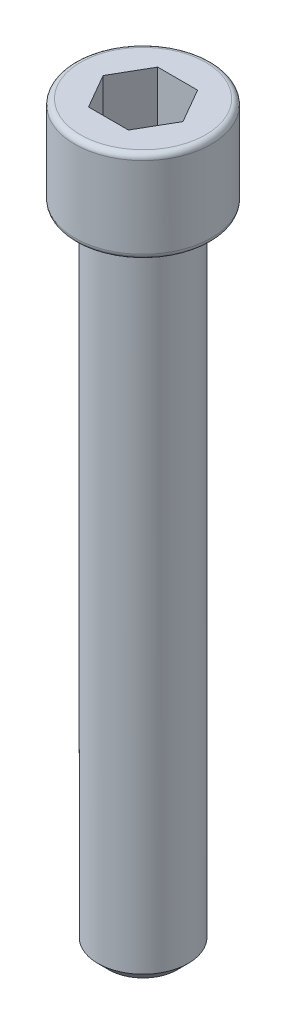
ISO-10303-21;
HEADER;
FILE_DESCRIPTION(('STEP AP214'),'2;1');
FILE_NAME('part.step','',(''),(''),'','','');
FILE_SCHEMA(('AUTOMOTIVE_DESIGN { 1 0 10303 214 1 1 1 1 }'));
ENDSEC;
DATA;
#1=APPLICATION_CONTEXT('core data for automotive mechanical design processes');
#2=APPLICATION_PROTOCOL_DEFINITION('international standard','automotive_design',2000,#1);
#3=PRODUCT_CONTEXT('',#1,'mechanical');
#4=PRODUCT('Part','Part','',(#3));
#5=PRODUCT_RELATED_PRODUCT_CATEGORY('part','',(#4));
#6=PRODUCT_DEFINITION_FORMATION('','',#4);
#7=PRODUCT_DEFINITION_CONTEXT('part definition',#1,'design');
#8=PRODUCT_DEFINITION('design','',#6,#7);
#9=PRODUCT_DEFINITION_SHAPE('','',#8);
#10=(LENGTH_UNIT() NAMED_UNIT(*) SI_UNIT(.MILLI.,.METRE.));
#11=(NAMED_UNIT(*) PLANE_ANGLE_UNIT() SI_UNIT($,.RADIAN.));
#12=(NAMED_UNIT(*) SI_UNIT($,.STERADIAN.) SOLID_ANGLE_UNIT());
#13=UNCERTAINTY_MEASURE_WITH_UNIT(LENGTH_MEASURE(1.E-05),#10,'distance_accuracy_value','');
#14=(GEOMETRIC_REPRESENTATION_CONTEXT(3) GLOBAL_UNCERTAINTY_ASSIGNED_CONTEXT((#13)) GLOBAL_UNIT_ASSIGNED_CONTEXT((#10,
#11,#12)) REPRESENTATION_CONTEXT('',''));
#15=CARTESIAN_POINT('',(0.,0.,0.));
#16=DIRECTION('',(0.,0.,1.));
#17=DIRECTION('',(1.,0.,0.));
#18=AXIS2_PLACEMENT_3D('',#15,#16,#17);
#19=CARTESIAN_POINT('',(-3.1115,0.,0.));
#20=DIRECTION('',(0.,1.,0.));
#21=DIRECTION('',(0.,0.,1.));
#22=AXIS2_PLACEMENT_3D('',#19,#20,#21);
#23=PLANE('',#22);
#24=CARTESIAN_POINT('',(0.,0.,0.));
#25=DIRECTION('',(0.,1.,0.));
#26=DIRECTION('',(0.,0.,1.));
#27=AXIS2_PLACEMENT_3D('',#24,#25,#26);
#28=CIRCLE('',#27,2.34949999999999);
#29=CARTESIAN_POINT('',(0.,0.,2.34949999999999));
#30=VERTEX_POINT('',#29);
#31=EDGE_CURVE('E42',#30,#30,#28,.F.);
#32=ORIENTED_EDGE('',*,*,#31,.T.);
#33=EDGE_LOOP('',(#32));
#34=FACE_BOUND('',#33,.T.);
#35=ADVANCED_FACE('F34',(#34),#23,.F.);
#36=CARTESIAN_POINT('',(0.,50.8,0.));
#37=DIRECTION('',(0.,-1.,0.));
#38=DIRECTION('',(0.,0.,-1.));
#39=AXIS2_PLACEMENT_3D('',#36,#37,#38);
#40=PLANE('',#39);
#41=CARTESIAN_POINT('',(0.,50.8,0.));
#42=DIRECTION('',(0.,-1.,0.));
#43=DIRECTION('',(0.,0.,-1.));
#44=AXIS2_PLACEMENT_3D('',#41,#42,#43);
#45=CIRCLE('',#44,4.318);
#46=CARTESIAN_POINT('',(0.,50.8,-4.318));
#47=VERTEX_POINT('',#46);
#48=EDGE_CURVE('E153',#47,#47,#45,.F.);
#49=ORIENTED_EDGE('',*,*,#48,.T.);
#50=EDGE_LOOP('',(#49));
#51=FACE_BOUND('',#50,.T.);
#52=DIRECTION('',(-0.5,0.,-0.866025403784438));
#53=VECTOR('',#52,1.);
#54=CARTESIAN_POINT('',(2.74962619987152,50.8,0.));
#55=LINE('',#54,#53);
#56=CARTESIAN_POINT('',(2.74962619987152,50.8,0.));
#57=VERTEX_POINT('',#56);
#58=CARTESIAN_POINT('',(1.37481309993576,50.8,-2.38124614));
#59=VERTEX_POINT('',#58);
#60=EDGE_CURVE('E123',#57,#59,#55,.T.);
#61=ORIENTED_EDGE('',*,*,#60,.F.);
#62=DIRECTION('',(0.5,0.,-0.866025403784439));
#63=VECTOR('',#62,1.);
#64=CARTESIAN_POINT('',(1.37481309993576,50.8,2.38124614));
#65=LINE('',#64,#63);
#66=CARTESIAN_POINT('',(1.37481309993576,50.8,2.38124614));
#67=VERTEX_POINT('',#66);
#68=EDGE_CURVE('E49',#67,#57,#65,.T.);
#69=ORIENTED_EDGE('',*,*,#68,.F.);
#70=DIRECTION('',(1.,0.,0.));
#71=VECTOR('',#70,1.);
#72=CARTESIAN_POINT('',(-1.37481309993576,50.8,2.38124614));
#73=LINE('',#72,#71);
#74=CARTESIAN_POINT('',(-1.37481309993576,50.8,2.38124614));
#75=VERTEX_POINT('',#74);
#76=EDGE_CURVE('E132',#75,#67,#73,.T.);
#77=ORIENTED_EDGE('',*,*,#76,.F.);
#78=DIRECTION('',(0.5,0.,0.866025403784439));
#79=VECTOR('',#78,1.);
#80=CARTESIAN_POINT('',(-2.74962619987151,50.8,0.));
#81=LINE('',#80,#79);
#82=CARTESIAN_POINT('',(-2.74962619987151,50.8,0.));
#83=VERTEX_POINT('',#82);
#84=EDGE_CURVE('E130',#83,#75,#81,.T.);
#85=ORIENTED_EDGE('',*,*,#84,.F.);
#86=DIRECTION('',(-0.5,0.,0.866025403784439));
#87=VECTOR('',#86,1.);
#88=CARTESIAN_POINT('',(-1.37481309993576,50.8,-2.38124614));
#89=LINE('',#88,#87);
#90=CARTESIAN_POINT('',(-1.37481309993576,50.8,-2.38124614));
#91=VERTEX_POINT('',#90);
#92=EDGE_CURVE('E97',#91,#83,#89,.T.);
#93=ORIENTED_EDGE('',*,*,#92,.F.);
#94=DIRECTION('',(-1.,0.,0.));
#95=VECTOR('',#94,1.);
#96=CARTESIAN_POINT('',(1.37481309993576,50.8,-2.38124614));
#97=LINE('',#96,#95);
#98=EDGE_CURVE('E126',#59,#91,#97,.T.);
#99=ORIENTED_EDGE('',*,*,#98,.F.);
#100=EDGE_LOOP('',(#61,#69,#77,#85,#93,#99));
#101=FACE_BOUND('',#100,.T.);
#102=ADVANCED_FACE('F169',(#51,#101),#40,.F.);
#103=CARTESIAN_POINT('',(0.,0.,0.));
#104=DIRECTION('',(0.,-1.,0.));
#105=DIRECTION('',(0.,0.,-1.));
#106=AXIS2_PLACEMENT_3D('',#103,#104,#105);
#107=CYLINDRICAL_SURFACE('',#106,4.699);
#108=CARTESIAN_POINT('',(0.,44.831,0.));
#109=DIRECTION('',(0.,1.,0.));
#110=DIRECTION('',(0.,0.,1.));
#111=AXIS2_PLACEMENT_3D('',#108,#109,#110);
#112=CIRCLE('',#111,4.699);
#113=CARTESIAN_POINT('',(0.,44.831,4.699));
#114=VERTEX_POINT('',#113);
#115=EDGE_CURVE('E150',#114,#114,#112,.T.);
#116=ORIENTED_EDGE('',*,*,#115,.T.);
#117=EDGE_LOOP('',(#116));
#118=FACE_BOUND('',#117,.T.);
#119=CARTESIAN_POINT('',(0.,50.419,0.));
#120=DIRECTION('',(0.,-1.,0.));
#121=DIRECTION('',(0.,0.,-1.));
#122=AXIS2_PLACEMENT_3D('',#119,#120,#121);
#123=CIRCLE('',#122,4.699);
#124=CARTESIAN_POINT('',(0.,50.419,-4.699));
#125=VERTEX_POINT('',#124);
#126=EDGE_CURVE('E147',#125,#125,#123,.T.);
#127=ORIENTED_EDGE('',*,*,#126,.T.);
#128=EDGE_LOOP('',(#127));
#129=FACE_BOUND('',#128,.T.);
#130=ADVANCED_FACE('F174',(#118,#129),#107,.T.);
#131=CARTESIAN_POINT('',(-4.699,44.45,0.));
#132=DIRECTION('',(0.,1.,0.));
#133=DIRECTION('',(0.,0.,1.));
#134=AXIS2_PLACEMENT_3D('',#131,#132,#133);
#135=PLANE('',#134);
#136=CARTESIAN_POINT('',(0.,44.45,0.));
#137=DIRECTION('',(0.,1.,0.));
#138=DIRECTION('',(0.,0.,1.));
#139=AXIS2_PLACEMENT_3D('',#136,#137,#138);
#140=CIRCLE('',#139,4.318);
#141=CARTESIAN_POINT('',(0.,44.45,4.318));
#142=VERTEX_POINT('',#141);
#143=EDGE_CURVE('E144',#142,#142,#140,.F.);
#144=ORIENTED_EDGE('',*,*,#143,.T.);
#145=EDGE_LOOP('',(#144));
#146=FACE_BOUND('',#145,.T.);
#147=CARTESIAN_POINT('',(0.,44.45,0.));
#148=DIRECTION('',(0.,-1.,0.));
#149=DIRECTION('',(0.,0.,-1.));
#150=AXIS2_PLACEMENT_3D('',#147,#148,#149);
#151=CIRCLE('',#150,3.1115);
#152=CARTESIAN_POINT('',(0.,44.45,-3.1115));
#153=VERTEX_POINT('',#152);
#154=EDGE_CURVE('E136',#153,#153,#151,.T.);
#155=ORIENTED_EDGE('',*,*,#154,.F.);
#156=EDGE_LOOP('',(#155));
#157=FACE_BOUND('',#156,.T.);
#158=ADVANCED_FACE('F190',(#146,#157),#135,.F.);
#159=CARTESIAN_POINT('',(0.,0.,0.));
#160=DIRECTION('',(0.,-1.,0.));
#161=DIRECTION('',(0.,0.,-1.));
#162=AXIS2_PLACEMENT_3D('',#159,#160,#161);
#163=CYLINDRICAL_SURFACE('',#162,3.1115);
#164=CARTESIAN_POINT('',(0.,0.762000000000011,0.));
#165=DIRECTION('',(0.,1.,0.));
#166=DIRECTION('',(0.,0.,1.));
#167=AXIS2_PLACEMENT_3D('',#164,#165,#166);
#168=CIRCLE('',#167,3.1115);
#169=CARTESIAN_POINT('',(0.,0.762000000000011,3.1115));
#170=VERTEX_POINT('',#169);
#171=EDGE_CURVE('E11',#170,#170,#168,.T.);
#172=ORIENTED_EDGE('',*,*,#171,.T.);
#173=EDGE_LOOP('',(#172));
#174=FACE_BOUND('',#173,.T.);
#175=ORIENTED_EDGE('',*,*,#154,.T.);
#176=EDGE_LOOP('',(#175));
#177=FACE_BOUND('',#176,.T.);
#178=ADVANCED_FACE('F193',(#174,#177),#163,.T.);
#179=CARTESIAN_POINT('',(1.37481309993576,46.99,2.38124614));
#180=DIRECTION('',(0.866025403784439,0.,0.5));
#181=DIRECTION('',(0.5,0.,-0.866025403784439));
#182=AXIS2_PLACEMENT_3D('',#179,#180,#181);
#183=PLANE('',#182);
#184=ORIENTED_EDGE('',*,*,#68,.T.);
#185=DIRECTION('',(0.,1.,0.));
#186=VECTOR('',#185,1.);
#187=CARTESIAN_POINT('',(2.74962619987152,46.99,0.));
#188=LINE('',#187,#186);
#189=CARTESIAN_POINT('',(2.74962619987152,46.99,0.));
#190=VERTEX_POINT('',#189);
#191=EDGE_CURVE('E79',#190,#57,#188,.T.);
#192=ORIENTED_EDGE('',*,*,#191,.F.);
#193=DIRECTION('',(0.5,0.,-0.866025403784439));
#194=VECTOR('',#193,1.);
#195=CARTESIAN_POINT('',(1.37481309993576,46.99,2.38124614));
#196=LINE('',#195,#194);
#197=CARTESIAN_POINT('',(1.37481309993576,46.99,2.38124614));
#198=VERTEX_POINT('',#197);
#199=EDGE_CURVE('E134',#198,#190,#196,.T.);
#200=ORIENTED_EDGE('',*,*,#199,.F.);
#201=DIRECTION('',(0.,1.,0.));
#202=VECTOR('',#201,1.);
#203=CARTESIAN_POINT('',(1.37481309993576,46.99,2.38124614));
#204=LINE('',#203,#202);
#205=EDGE_CURVE('E57',#198,#67,#204,.T.);
#206=ORIENTED_EDGE('',*,*,#205,.T.);
#207=EDGE_LOOP('',(#184,#192,#200,#206));
#208=FACE_BOUND('',#207,.T.);
#209=ADVANCED_FACE('F198',(#208),#183,.F.);
#210=CARTESIAN_POINT('',(-1.37481309993576,46.99,2.38124614));
#211=DIRECTION('',(0.,0.,1.));
#212=DIRECTION('',(1.,0.,0.));
#213=AXIS2_PLACEMENT_3D('',#210,#211,#212);
#214=PLANE('',#213);
#215=ORIENTED_EDGE('',*,*,#76,.T.);
#216=ORIENTED_EDGE('',*,*,#205,.F.);
#217=DIRECTION('',(1.,0.,0.));
#218=VECTOR('',#217,1.);
#219=CARTESIAN_POINT('',(-1.37481309993576,46.99,2.38124614));
#220=LINE('',#219,#218);
#221=CARTESIAN_POINT('',(-1.37481309993576,46.99,2.38124614));
#222=VERTEX_POINT('',#221);
#223=EDGE_CURVE('E109',#222,#198,#220,.T.);
#224=ORIENTED_EDGE('',*,*,#223,.F.);
#225=DIRECTION('',(0.,1.,0.));
#226=VECTOR('',#225,1.);
#227=CARTESIAN_POINT('',(-1.37481309993576,46.99,2.38124614));
#228=LINE('',#227,#226);
#229=EDGE_CURVE('E101',#222,#75,#228,.T.);
#230=ORIENTED_EDGE('',*,*,#229,.T.);
#231=EDGE_LOOP('',(#215,#216,#224,#230));
#232=FACE_BOUND('',#231,.T.);
#233=ADVANCED_FACE('F204',(#232),#214,.F.);
#234=CARTESIAN_POINT('',(-2.74962619987151,46.99,0.));
#235=DIRECTION('',(-0.866025403784438,0.,0.5));
#236=DIRECTION('',(0.5,0.,0.866025403784439));
#237=AXIS2_PLACEMENT_3D('',#234,#235,#236);
#238=PLANE('',#237);
#239=ORIENTED_EDGE('',*,*,#84,.T.);
#240=ORIENTED_EDGE('',*,*,#229,.F.);
#241=DIRECTION('',(0.5,0.,0.866025403784439));
#242=VECTOR('',#241,1.);
#243=CARTESIAN_POINT('',(-2.74962619987151,46.99,0.));
#244=LINE('',#243,#242);
#245=CARTESIAN_POINT('',(-2.74962619987151,46.99,0.));
#246=VERTEX_POINT('',#245);
#247=EDGE_CURVE('E105',#246,#222,#244,.T.);
#248=ORIENTED_EDGE('',*,*,#247,.F.);
#249=DIRECTION('',(0.,1.,0.));
#250=VECTOR('',#249,1.);
#251=CARTESIAN_POINT('',(-2.74962619987151,46.99,0.));
#252=LINE('',#251,#250);
#253=EDGE_CURVE('E90',#246,#83,#252,.T.);
#254=ORIENTED_EDGE('',*,*,#253,.T.);
#255=EDGE_LOOP('',(#239,#240,#248,#254));
#256=FACE_BOUND('',#255,.T.);
#257=ADVANCED_FACE('F106',(#256),#238,.F.);
#258=CARTESIAN_POINT('',(-1.37481309993576,46.99,-2.38124614));
#259=DIRECTION('',(-0.866025403784439,0.,-0.5));
#260=DIRECTION('',(-0.5,0.,0.866025403784439));
#261=AXIS2_PLACEMENT_3D('',#258,#259,#260);
#262=PLANE('',#261);
#263=ORIENTED_EDGE('',*,*,#92,.T.);
#264=ORIENTED_EDGE('',*,*,#253,.F.);
#265=DIRECTION('',(-0.5,0.,0.866025403784439));
#266=VECTOR('',#265,1.);
#267=CARTESIAN_POINT('',(-1.37481309993576,46.99,-2.38124614));
#268=LINE('',#267,#266);
#269=CARTESIAN_POINT('',(-1.37481309993576,46.99,-2.38124614));
#270=VERTEX_POINT('',#269);
#271=EDGE_CURVE('E94',#270,#246,#268,.T.);
#272=ORIENTED_EDGE('',*,*,#271,.F.);
#273=DIRECTION('',(0.,1.,0.));
#274=VECTOR('',#273,1.);
#275=CARTESIAN_POINT('',(-1.37481309993576,46.99,-2.38124614));
#276=LINE('',#275,#274);
#277=EDGE_CURVE('E102',#270,#91,#276,.T.);
#278=ORIENTED_EDGE('',*,*,#277,.T.);
#279=EDGE_LOOP('',(#263,#264,#272,#278));
#280=FACE_BOUND('',#279,.T.);
#281=ADVANCED_FACE('F92',(#280),#262,.F.);
#282=CARTESIAN_POINT('',(1.37481309993576,46.99,-2.38124614));
#283=DIRECTION('',(0.,0.,-1.));
#284=DIRECTION('',(-1.,0.,0.));
#285=AXIS2_PLACEMENT_3D('',#282,#283,#284);
#286=PLANE('',#285);
#287=ORIENTED_EDGE('',*,*,#98,.T.);
#288=ORIENTED_EDGE('',*,*,#277,.F.);
#289=DIRECTION('',(-1.,0.,0.));
#290=VECTOR('',#289,1.);
#291=CARTESIAN_POINT('',(1.37481309993576,46.99,-2.38124614));
#292=LINE('',#291,#290);
#293=CARTESIAN_POINT('',(1.37481309993576,46.99,-2.38124614));
#294=VERTEX_POINT('',#293);
#295=EDGE_CURVE('E115',#294,#270,#292,.T.);
#296=ORIENTED_EDGE('',*,*,#295,.F.);
#297=DIRECTION('',(0.,1.,0.));
#298=VECTOR('',#297,1.);
#299=CARTESIAN_POINT('',(1.37481309993576,46.99,-2.38124614));
#300=LINE('',#299,#298);
#301=EDGE_CURVE('E139',#294,#59,#300,.T.);
#302=ORIENTED_EDGE('',*,*,#301,.T.);
#303=EDGE_LOOP('',(#287,#288,#296,#302));
#304=FACE_BOUND('',#303,.T.);
#305=ADVANCED_FACE('F273',(#304),#286,.F.);
#306=CARTESIAN_POINT('',(2.74962619987152,46.99,0.));
#307=DIRECTION('',(0.866025403784438,0.,-0.5));
#308=DIRECTION('',(-0.5,0.,-0.866025403784439));
#309=AXIS2_PLACEMENT_3D('',#306,#307,#308);
#310=PLANE('',#309);
#311=ORIENTED_EDGE('',*,*,#60,.T.);
#312=ORIENTED_EDGE('',*,*,#301,.F.);
#313=DIRECTION('',(-0.5,0.,-0.866025403784438));
#314=VECTOR('',#313,1.);
#315=CARTESIAN_POINT('',(2.74962619987152,46.99,0.));
#316=LINE('',#315,#314);
#317=EDGE_CURVE('E117',#190,#294,#316,.T.);
#318=ORIENTED_EDGE('',*,*,#317,.F.);
#319=ORIENTED_EDGE('',*,*,#191,.T.);
#320=EDGE_LOOP('',(#311,#312,#318,#319));
#321=FACE_BOUND('',#320,.T.);
#322=ADVANCED_FACE('F184',(#321),#310,.F.);
#323=CARTESIAN_POINT('',(2.74962619987152,46.99,0.));
#324=DIRECTION('',(0.,1.,0.));
#325=DIRECTION('',(0.,0.,1.));
#326=AXIS2_PLACEMENT_3D('',#323,#324,#325);
#327=PLANE('',#326);
#328=ORIENTED_EDGE('',*,*,#199,.T.);
#329=ORIENTED_EDGE('',*,*,#317,.T.);
#330=ORIENTED_EDGE('',*,*,#295,.T.);
#331=ORIENTED_EDGE('',*,*,#271,.T.);
#332=ORIENTED_EDGE('',*,*,#247,.T.);
#333=ORIENTED_EDGE('',*,*,#223,.T.);
#334=EDGE_LOOP('',(#328,#329,#330,#331,#332,#333));
#335=FACE_BOUND('',#334,.T.);
#336=ADVANCED_FACE('F112',(#335),#327,.T.);
#337=CARTESIAN_POINT('',(0.,44.831,0.));
#338=DIRECTION('',(0.,1.,0.));
#339=DIRECTION('',(0.,0.,1.));
#340=AXIS2_PLACEMENT_3D('',#337,#338,#339);
#341=TOROIDAL_SURFACE('',#340,4.318,0.381);
#342=ORIENTED_EDGE('',*,*,#115,.F.);
#343=EDGE_LOOP('',(#342));
#344=FACE_BOUND('',#343,.T.);
#345=ORIENTED_EDGE('',*,*,#143,.F.);
#346=EDGE_LOOP('',(#345));
#347=FACE_BOUND('',#346,.T.);
#348=ADVANCED_FACE('F165',(#344,#347),#341,.T.);
#349=CARTESIAN_POINT('',(0.,50.419,0.));
#350=DIRECTION('',(0.,-1.,0.));
#351=DIRECTION('',(0.,0.,-1.));
#352=AXIS2_PLACEMENT_3D('',#349,#350,#351);
#353=TOROIDAL_SURFACE('',#352,4.318,0.381);
#354=ORIENTED_EDGE('',*,*,#48,.F.);
#355=EDGE_LOOP('',(#354));
#356=FACE_BOUND('',#355,.T.);
#357=ORIENTED_EDGE('',*,*,#126,.F.);
#358=EDGE_LOOP('',(#357));
#359=FACE_BOUND('',#358,.T.);
#360=ADVANCED_FACE('F160',(#356,#359),#353,.T.);
#361=CARTESIAN_POINT('',(0.,0.,0.));
#362=DIRECTION('',(0.,1.,0.));
#363=DIRECTION('',(0.,0.,1.));
#364=AXIS2_PLACEMENT_3D('',#361,#362,#363);
#365=CONICAL_SURFACE('',#364,2.34949999999999,0.785398163397446);
#366=ORIENTED_EDGE('',*,*,#171,.F.);
#367=EDGE_LOOP('',(#366));
#368=FACE_BOUND('',#367,.T.);
#369=ORIENTED_EDGE('',*,*,#31,.F.);
#370=EDGE_LOOP('',(#369));
#371=FACE_BOUND('',#370,.T.);
#372=ADVANCED_FACE('F36',(#368,#371),#365,.T.);
#373=CLOSED_SHELL('',(#35,#102,#130,#158,#178,#209,#233,#257,#281,#305,#322,#336,#348,#360,#372));
#374=MANIFOLD_SOLID_BREP('B2',#373);
#375=ADVANCED_BREP_SHAPE_REPRESENTATION('',(#18,#374),#14);
#376=SHAPE_DEFINITION_REPRESENTATION(#9,#375);
ENDSEC;
END-ISO-10303-21;
